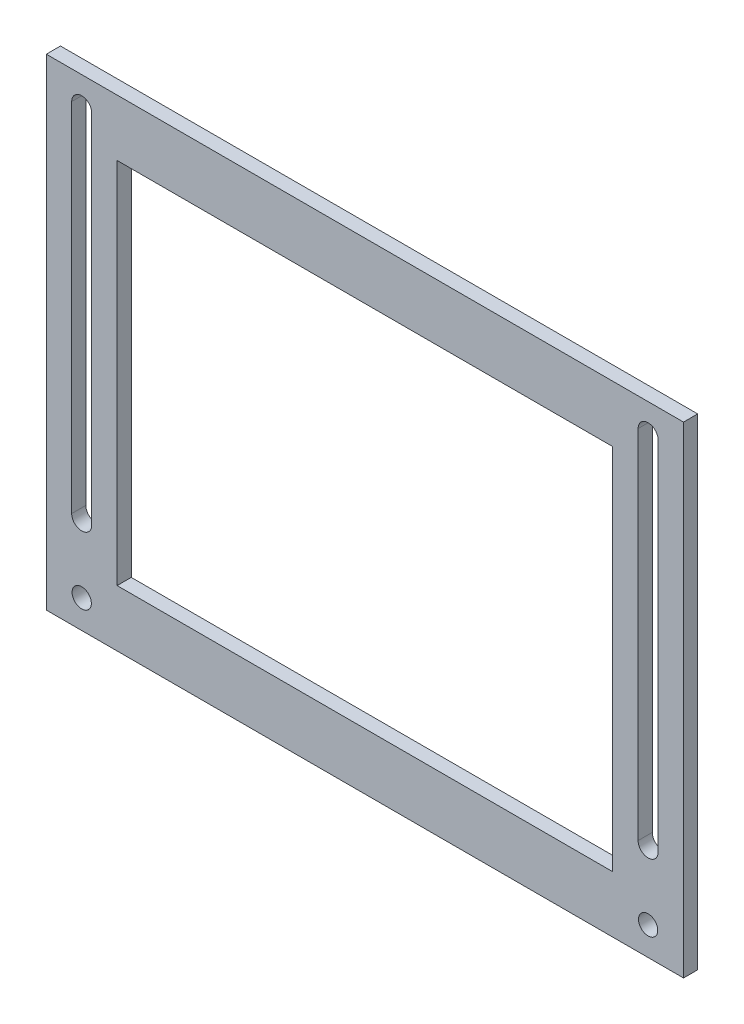
ISO-10303-21;
HEADER;
FILE_DESCRIPTION(('STEP AP214'),'2;1');
FILE_NAME('part.step','',(''),(''),'','','');
FILE_SCHEMA(('AUTOMOTIVE_DESIGN { 1 0 10303 214 1 1 1 1 }'));
ENDSEC;
DATA;
#1=APPLICATION_CONTEXT('core data for automotive mechanical design processes');
#2=APPLICATION_PROTOCOL_DEFINITION('international standard','automotive_design',2000,#1);
#3=PRODUCT_CONTEXT('',#1,'mechanical');
#4=PRODUCT('Part','Part','',(#3));
#5=PRODUCT_RELATED_PRODUCT_CATEGORY('part','',(#4));
#6=PRODUCT_DEFINITION_FORMATION('','',#4);
#7=PRODUCT_DEFINITION_CONTEXT('part definition',#1,'design');
#8=PRODUCT_DEFINITION('design','',#6,#7);
#9=PRODUCT_DEFINITION_SHAPE('','',#8);
#10=(LENGTH_UNIT() NAMED_UNIT(*) SI_UNIT(.MILLI.,.METRE.));
#11=(NAMED_UNIT(*) PLANE_ANGLE_UNIT() SI_UNIT($,.RADIAN.));
#12=(NAMED_UNIT(*) SI_UNIT($,.STERADIAN.) SOLID_ANGLE_UNIT());
#13=UNCERTAINTY_MEASURE_WITH_UNIT(LENGTH_MEASURE(1.E-05),#10,'distance_accuracy_value','');
#14=(GEOMETRIC_REPRESENTATION_CONTEXT(3) GLOBAL_UNCERTAINTY_ASSIGNED_CONTEXT((#13)) GLOBAL_UNIT_ASSIGNED_CONTEXT((#10,
#11,#12)) REPRESENTATION_CONTEXT('',''));
#15=CARTESIAN_POINT('',(0.,0.,0.));
#16=DIRECTION('',(0.,0.,1.));
#17=DIRECTION('',(1.,0.,0.));
#18=AXIS2_PLACEMENT_3D('',#15,#16,#17);
#19=CARTESIAN_POINT('',(0.,0.,3.175));
#20=DIRECTION('',(0.,0.,-1.));
#21=DIRECTION('',(-1.,0.,0.));
#22=AXIS2_PLACEMENT_3D('',#19,#20,#21);
#23=PLANE('',#22);
#24=CARTESIAN_POINT('',(134.9375,6.35,3.175));
#25=DIRECTION('',(0.,0.,1.));
#26=DIRECTION('',(-1.,0.,0.));
#27=AXIS2_PLACEMENT_3D('',#24,#25,#26);
#28=CIRCLE('',#27,2.15899999999999);
#29=CARTESIAN_POINT('',(132.7785,6.35,3.175));
#30=VERTEX_POINT('',#29);
#31=EDGE_CURVE('E182',#30,#30,#28,.T.);
#32=ORIENTED_EDGE('',*,*,#31,.F.);
#33=EDGE_LOOP('',(#32));
#34=FACE_BOUND('',#33,.T.);
#35=DIRECTION('',(-1.,0.,0.));
#36=VECTOR('',#35,1.);
#37=CARTESIAN_POINT('',(15.875,95.25,3.175));
#38=LINE('',#37,#36);
#39=CARTESIAN_POINT('',(127.,95.25,3.175));
#40=VERTEX_POINT('',#39);
#41=CARTESIAN_POINT('',(15.875,95.25,3.175));
#42=VERTEX_POINT('',#41);
#43=EDGE_CURVE('E188',#40,#42,#38,.T.);
#44=ORIENTED_EDGE('',*,*,#43,.F.);
#45=DIRECTION('',(0.,1.,0.));
#46=VECTOR('',#45,1.);
#47=CARTESIAN_POINT('',(127.,12.7,3.175));
#48=LINE('',#47,#46);
#49=CARTESIAN_POINT('',(127.,12.7,3.175));
#50=VERTEX_POINT('',#49);
#51=EDGE_CURVE('E196',#50,#40,#48,.T.);
#52=ORIENTED_EDGE('',*,*,#51,.F.);
#53=DIRECTION('',(1.,0.,0.));
#54=VECTOR('',#53,1.);
#55=CARTESIAN_POINT('',(15.875,12.7,3.175));
#56=LINE('',#55,#54);
#57=CARTESIAN_POINT('',(15.875,12.7,3.175));
#58=VERTEX_POINT('',#57);
#59=EDGE_CURVE('E193',#58,#50,#56,.T.);
#60=ORIENTED_EDGE('',*,*,#59,.F.);
#61=DIRECTION('',(0.,-1.,0.));
#62=VECTOR('',#61,1.);
#63=CARTESIAN_POINT('',(15.875,12.7,3.175));
#64=LINE('',#63,#62);
#65=EDGE_CURVE('E190',#42,#58,#64,.T.);
#66=ORIENTED_EDGE('',*,*,#65,.F.);
#67=EDGE_LOOP('',(#44,#52,#60,#66));
#68=FACE_BOUND('',#67,.T.);
#69=DIRECTION('',(0.,-1.,0.));
#70=VECTOR('',#69,1.);
#71=CARTESIAN_POINT('',(0.,0.,3.175));
#72=LINE('',#71,#70);
#73=CARTESIAN_POINT('',(0.,107.95,3.175));
#74=VERTEX_POINT('',#73);
#75=CARTESIAN_POINT('',(0.,0.,3.175));
#76=VERTEX_POINT('',#75);
#77=EDGE_CURVE('E256',#74,#76,#72,.T.);
#78=ORIENTED_EDGE('',*,*,#77,.T.);
#79=DIRECTION('',(1.,0.,0.));
#80=VECTOR('',#79,1.);
#81=CARTESIAN_POINT('',(0.,0.,3.175));
#82=LINE('',#81,#80);
#83=CARTESIAN_POINT('',(142.875,0.,3.175));
#84=VERTEX_POINT('',#83);
#85=EDGE_CURVE('E259',#76,#84,#82,.T.);
#86=ORIENTED_EDGE('',*,*,#85,.T.);
#87=DIRECTION('',(0.,1.,0.));
#88=VECTOR('',#87,1.);
#89=CARTESIAN_POINT('',(142.875,0.,3.175));
#90=LINE('',#89,#88);
#91=CARTESIAN_POINT('',(142.875,107.95,3.175));
#92=VERTEX_POINT('',#91);
#93=EDGE_CURVE('E262',#84,#92,#90,.T.);
#94=ORIENTED_EDGE('',*,*,#93,.T.);
#95=DIRECTION('',(-1.,0.,0.));
#96=VECTOR('',#95,1.);
#97=CARTESIAN_POINT('',(142.875,107.95,3.175));
#98=LINE('',#97,#96);
#99=EDGE_CURVE('E264',#92,#74,#98,.T.);
#100=ORIENTED_EDGE('',*,*,#99,.T.);
#101=EDGE_LOOP('',(#78,#86,#94,#100));
#102=FACE_BOUND('',#101,.T.);
#103=CARTESIAN_POINT('',(7.9375,101.6,3.175));
#104=DIRECTION('',(0.,0.,1.));
#105=DIRECTION('',(1.,0.,0.));
#106=AXIS2_PLACEMENT_3D('',#103,#104,#105);
#107=CIRCLE('',#106,2.2479);
#108=CARTESIAN_POINT('',(10.1854,101.6,3.175));
#109=VERTEX_POINT('',#108);
#110=CARTESIAN_POINT('',(5.6896,101.6,3.175));
#111=VERTEX_POINT('',#110);
#112=EDGE_CURVE('E225',#109,#111,#107,.T.);
#113=ORIENTED_EDGE('',*,*,#112,.F.);
#114=DIRECTION('',(0.,1.,0.));
#115=VECTOR('',#114,1.);
#116=CARTESIAN_POINT('',(10.1854,101.6,3.175));
#117=LINE('',#116,#115);
#118=CARTESIAN_POINT('',(10.1854,21.59,3.175));
#119=VERTEX_POINT('',#118);
#120=EDGE_CURVE('E233',#119,#109,#117,.T.);
#121=ORIENTED_EDGE('',*,*,#120,.F.);
#122=CARTESIAN_POINT('',(7.93750000000001,21.59,3.175));
#123=DIRECTION('',(0.,0.,1.));
#124=DIRECTION('',(1.,0.,0.));
#125=AXIS2_PLACEMENT_3D('',#122,#123,#124);
#126=CIRCLE('',#125,2.2479);
#127=CARTESIAN_POINT('',(5.68960000000001,21.59,3.175));
#128=VERTEX_POINT('',#127);
#129=EDGE_CURVE('E230',#128,#119,#126,.T.);
#130=ORIENTED_EDGE('',*,*,#129,.F.);
#131=DIRECTION('',(0.,-1.,0.));
#132=VECTOR('',#131,1.);
#133=CARTESIAN_POINT('',(5.6896,101.6,3.175));
#134=LINE('',#133,#132);
#135=EDGE_CURVE('E227',#111,#128,#134,.T.);
#136=ORIENTED_EDGE('',*,*,#135,.F.);
#137=EDGE_LOOP('',(#113,#121,#130,#136));
#138=FACE_BOUND('',#137,.T.);
#139=CARTESIAN_POINT('',(7.9375,6.35,3.175));
#140=DIRECTION('',(0.,0.,1.));
#141=DIRECTION('',(1.,0.,0.));
#142=AXIS2_PLACEMENT_3D('',#139,#140,#141);
#143=CIRCLE('',#142,2.159);
#144=CARTESIAN_POINT('',(10.0965,6.35,3.175));
#145=VERTEX_POINT('',#144);
#146=EDGE_CURVE('E219',#145,#145,#143,.T.);
#147=ORIENTED_EDGE('',*,*,#146,.F.);
#148=EDGE_LOOP('',(#147));
#149=FACE_BOUND('',#148,.T.);
#150=CARTESIAN_POINT('',(134.9375,101.6,3.175));
#151=DIRECTION('',(0.,0.,1.));
#152=DIRECTION('',(-1.,0.,0.));
#153=AXIS2_PLACEMENT_3D('',#150,#151,#152);
#154=CIRCLE('',#153,2.24789999999998);
#155=CARTESIAN_POINT('',(137.1854,101.6,3.175));
#156=VERTEX_POINT('',#155);
#157=CARTESIAN_POINT('',(132.6896,101.6,3.175));
#158=VERTEX_POINT('',#157);
#159=EDGE_CURVE('E146',#156,#158,#154,.T.);
#160=ORIENTED_EDGE('',*,*,#159,.F.);
#161=DIRECTION('',(0.,1.,0.));
#162=VECTOR('',#161,1.);
#163=CARTESIAN_POINT('',(137.1854,101.6,3.175));
#164=LINE('',#163,#162);
#165=CARTESIAN_POINT('',(137.1854,21.59,3.175));
#166=VERTEX_POINT('',#165);
#167=EDGE_CURVE('E168',#166,#156,#164,.T.);
#168=ORIENTED_EDGE('',*,*,#167,.F.);
#169=CARTESIAN_POINT('',(134.9375,21.59,3.175));
#170=DIRECTION('',(0.,0.,1.));
#171=DIRECTION('',(-1.,0.,0.));
#172=AXIS2_PLACEMENT_3D('',#169,#170,#171);
#173=CIRCLE('',#172,2.24790000000001);
#174=CARTESIAN_POINT('',(132.6896,21.59,3.175));
#175=VERTEX_POINT('',#174);
#176=EDGE_CURVE('E166',#175,#166,#173,.T.);
#177=ORIENTED_EDGE('',*,*,#176,.F.);
#178=DIRECTION('',(0.,-1.,0.));
#179=VECTOR('',#178,1.);
#180=CARTESIAN_POINT('',(132.6896,101.6,3.175));
#181=LINE('',#180,#179);
#182=EDGE_CURVE('E154',#158,#175,#181,.T.);
#183=ORIENTED_EDGE('',*,*,#182,.F.);
#184=EDGE_LOOP('',(#160,#168,#177,#183));
#185=FACE_BOUND('',#184,.T.);
#186=ADVANCED_FACE('F33',(#34,#68,#102,#138,#149,#185),#23,.F.);
#187=CARTESIAN_POINT('',(0.,0.,0.));
#188=DIRECTION('',(0.,0.,-1.));
#189=DIRECTION('',(-1.,0.,0.));
#190=AXIS2_PLACEMENT_3D('',#187,#188,#189);
#191=PLANE('',#190);
#192=DIRECTION('',(0.,1.,0.));
#193=VECTOR('',#192,1.);
#194=CARTESIAN_POINT('',(127.,12.7,0.));
#195=LINE('',#194,#193);
#196=CARTESIAN_POINT('',(127.,12.7,0.));
#197=VERTEX_POINT('',#196);
#198=CARTESIAN_POINT('',(127.,95.25,0.));
#199=VERTEX_POINT('',#198);
#200=EDGE_CURVE('E191',#197,#199,#195,.T.);
#201=ORIENTED_EDGE('',*,*,#200,.T.);
#202=DIRECTION('',(-1.,0.,0.));
#203=VECTOR('',#202,1.);
#204=CARTESIAN_POINT('',(15.875,95.25,0.));
#205=LINE('',#204,#203);
#206=CARTESIAN_POINT('',(15.875,95.25,0.));
#207=VERTEX_POINT('',#206);
#208=EDGE_CURVE('E185',#199,#207,#205,.T.);
#209=ORIENTED_EDGE('',*,*,#208,.T.);
#210=DIRECTION('',(0.,-1.,0.));
#211=VECTOR('',#210,1.);
#212=CARTESIAN_POINT('',(15.875,12.7,0.));
#213=LINE('',#212,#211);
#214=CARTESIAN_POINT('',(15.875,12.7,0.));
#215=VERTEX_POINT('',#214);
#216=EDGE_CURVE('E201',#207,#215,#213,.T.);
#217=ORIENTED_EDGE('',*,*,#216,.T.);
#218=DIRECTION('',(1.,0.,0.));
#219=VECTOR('',#218,1.);
#220=CARTESIAN_POINT('',(15.875,12.7,0.));
#221=LINE('',#220,#219);
#222=EDGE_CURVE('E204',#215,#197,#221,.T.);
#223=ORIENTED_EDGE('',*,*,#222,.T.);
#224=EDGE_LOOP('',(#201,#209,#217,#223));
#225=FACE_BOUND('',#224,.T.);
#226=CARTESIAN_POINT('',(7.9375,6.35,0.));
#227=DIRECTION('',(0.,0.,1.));
#228=DIRECTION('',(1.,0.,0.));
#229=AXIS2_PLACEMENT_3D('',#226,#227,#228);
#230=CIRCLE('',#229,2.159);
#231=CARTESIAN_POINT('',(10.0965,6.35,0.));
#232=VERTEX_POINT('',#231);
#233=EDGE_CURVE('E218',#232,#232,#230,.T.);
#234=ORIENTED_EDGE('',*,*,#233,.T.);
#235=EDGE_LOOP('',(#234));
#236=FACE_BOUND('',#235,.T.);
#237=DIRECTION('',(0.,-1.,0.));
#238=VECTOR('',#237,1.);
#239=CARTESIAN_POINT('',(0.,0.,0.));
#240=LINE('',#239,#238);
#241=CARTESIAN_POINT('',(0.,107.95,0.));
#242=VERTEX_POINT('',#241);
#243=CARTESIAN_POINT('',(0.,0.,0.));
#244=VERTEX_POINT('',#243);
#245=EDGE_CURVE('E255',#242,#244,#240,.T.);
#246=ORIENTED_EDGE('',*,*,#245,.F.);
#247=DIRECTION('',(-1.,0.,0.));
#248=VECTOR('',#247,1.);
#249=CARTESIAN_POINT('',(0.,107.95,0.));
#250=LINE('',#249,#248);
#251=CARTESIAN_POINT('',(142.875,107.95,0.));
#252=VERTEX_POINT('',#251);
#253=EDGE_CURVE('E260',#252,#242,#250,.T.);
#254=ORIENTED_EDGE('',*,*,#253,.F.);
#255=DIRECTION('',(0.,1.,0.));
#256=VECTOR('',#255,1.);
#257=CARTESIAN_POINT('',(142.875,0.,0.));
#258=LINE('',#257,#256);
#259=CARTESIAN_POINT('',(142.875,0.,0.));
#260=VERTEX_POINT('',#259);
#261=EDGE_CURVE('E271',#260,#252,#258,.T.);
#262=ORIENTED_EDGE('',*,*,#261,.F.);
#263=DIRECTION('',(1.,0.,0.));
#264=VECTOR('',#263,1.);
#265=CARTESIAN_POINT('',(142.875,0.,0.));
#266=LINE('',#265,#264);
#267=EDGE_CURVE('E269',#244,#260,#266,.T.);
#268=ORIENTED_EDGE('',*,*,#267,.F.);
#269=EDGE_LOOP('',(#246,#254,#262,#268));
#270=FACE_BOUND('',#269,.T.);
#271=DIRECTION('',(0.,1.,0.));
#272=VECTOR('',#271,1.);
#273=CARTESIAN_POINT('',(10.1854,101.6,0.));
#274=LINE('',#273,#272);
#275=CARTESIAN_POINT('',(10.1854,21.59,0.));
#276=VERTEX_POINT('',#275);
#277=CARTESIAN_POINT('',(10.1854,101.6,0.));
#278=VERTEX_POINT('',#277);
#279=EDGE_CURVE('E228',#276,#278,#274,.T.);
#280=ORIENTED_EDGE('',*,*,#279,.T.);
#281=CARTESIAN_POINT('',(7.9375,101.6,0.));
#282=DIRECTION('',(0.,0.,1.));
#283=DIRECTION('',(1.,0.,0.));
#284=AXIS2_PLACEMENT_3D('',#281,#282,#283);
#285=CIRCLE('',#284,2.2479);
#286=CARTESIAN_POINT('',(5.6896,101.6,0.));
#287=VERTEX_POINT('',#286);
#288=EDGE_CURVE('E222',#278,#287,#285,.T.);
#289=ORIENTED_EDGE('',*,*,#288,.T.);
#290=DIRECTION('',(0.,-1.,0.));
#291=VECTOR('',#290,1.);
#292=CARTESIAN_POINT('',(5.6896,101.6,0.));
#293=LINE('',#292,#291);
#294=CARTESIAN_POINT('',(5.68960000000001,21.59,0.));
#295=VERTEX_POINT('',#294);
#296=EDGE_CURVE('E238',#287,#295,#293,.T.);
#297=ORIENTED_EDGE('',*,*,#296,.T.);
#298=CARTESIAN_POINT('',(7.93750000000001,21.59,0.));
#299=DIRECTION('',(0.,0.,1.));
#300=DIRECTION('',(1.,0.,0.));
#301=AXIS2_PLACEMENT_3D('',#298,#299,#300);
#302=CIRCLE('',#301,2.2479);
#303=EDGE_CURVE('E241',#295,#276,#302,.T.);
#304=ORIENTED_EDGE('',*,*,#303,.T.);
#305=EDGE_LOOP('',(#280,#289,#297,#304));
#306=FACE_BOUND('',#305,.T.);
#307=CARTESIAN_POINT('',(134.9375,6.35,0.));
#308=DIRECTION('',(0.,0.,1.));
#309=DIRECTION('',(-1.,0.,0.));
#310=AXIS2_PLACEMENT_3D('',#307,#308,#309);
#311=CIRCLE('',#310,2.15899999999999);
#312=CARTESIAN_POINT('',(132.7785,6.35,0.));
#313=VERTEX_POINT('',#312);
#314=EDGE_CURVE('E162',#313,#313,#311,.T.);
#315=ORIENTED_EDGE('',*,*,#314,.T.);
#316=EDGE_LOOP('',(#315));
#317=FACE_BOUND('',#316,.T.);
#318=DIRECTION('',(0.,1.,0.));
#319=VECTOR('',#318,1.);
#320=CARTESIAN_POINT('',(137.1854,101.6,0.));
#321=LINE('',#320,#319);
#322=CARTESIAN_POINT('',(137.1854,21.59,0.));
#323=VERTEX_POINT('',#322);
#324=CARTESIAN_POINT('',(137.1854,101.6,0.));
#325=VERTEX_POINT('',#324);
#326=EDGE_CURVE('E155',#323,#325,#321,.T.);
#327=ORIENTED_EDGE('',*,*,#326,.T.);
#328=CARTESIAN_POINT('',(134.9375,101.6,0.));
#329=DIRECTION('',(0.,0.,1.));
#330=DIRECTION('',(-1.,0.,0.));
#331=AXIS2_PLACEMENT_3D('',#328,#329,#330);
#332=CIRCLE('',#331,2.24789999999998);
#333=CARTESIAN_POINT('',(132.6896,101.6,0.));
#334=VERTEX_POINT('',#333);
#335=EDGE_CURVE('E56',#325,#334,#332,.T.);
#336=ORIENTED_EDGE('',*,*,#335,.T.);
#337=DIRECTION('',(0.,-1.,0.));
#338=VECTOR('',#337,1.);
#339=CARTESIAN_POINT('',(132.6896,101.6,0.));
#340=LINE('',#339,#338);
#341=CARTESIAN_POINT('',(132.6896,21.59,0.));
#342=VERTEX_POINT('',#341);
#343=EDGE_CURVE('E161',#334,#342,#340,.T.);
#344=ORIENTED_EDGE('',*,*,#343,.T.);
#345=CARTESIAN_POINT('',(134.9375,21.59,0.));
#346=DIRECTION('',(0.,0.,1.));
#347=DIRECTION('',(-1.,0.,0.));
#348=AXIS2_PLACEMENT_3D('',#345,#346,#347);
#349=CIRCLE('',#348,2.24790000000001);
#350=EDGE_CURVE('E174',#342,#323,#349,.T.);
#351=ORIENTED_EDGE('',*,*,#350,.T.);
#352=EDGE_LOOP('',(#327,#336,#344,#351));
#353=FACE_BOUND('',#352,.T.);
#354=ADVANCED_FACE('F289',(#225,#236,#270,#306,#317,#353),#191,.T.);
#355=CARTESIAN_POINT('',(0.,0.,3.175));
#356=DIRECTION('',(1.,0.,0.));
#357=DIRECTION('',(0.,0.,-1.));
#358=AXIS2_PLACEMENT_3D('',#355,#356,#357);
#359=PLANE('',#358);
#360=ORIENTED_EDGE('',*,*,#245,.T.);
#361=DIRECTION('',(0.,0.,-1.));
#362=VECTOR('',#361,1.);
#363=CARTESIAN_POINT('',(0.,0.,3.175));
#364=LINE('',#363,#362);
#365=EDGE_CURVE('E11',#76,#244,#364,.T.);
#366=ORIENTED_EDGE('',*,*,#365,.F.);
#367=ORIENTED_EDGE('',*,*,#77,.F.);
#368=DIRECTION('',(0.,0.,-1.));
#369=VECTOR('',#368,1.);
#370=CARTESIAN_POINT('',(0.,107.95,3.175));
#371=LINE('',#370,#369);
#372=EDGE_CURVE('E266',#74,#242,#371,.T.);
#373=ORIENTED_EDGE('',*,*,#372,.T.);
#374=EDGE_LOOP('',(#360,#366,#367,#373));
#375=FACE_BOUND('',#374,.T.);
#376=ADVANCED_FACE('F35',(#375),#359,.F.);
#377=CARTESIAN_POINT('',(142.875,0.,3.175));
#378=DIRECTION('',(0.,1.,0.));
#379=DIRECTION('',(0.,0.,1.));
#380=AXIS2_PLACEMENT_3D('',#377,#378,#379);
#381=PLANE('',#380);
#382=ORIENTED_EDGE('',*,*,#267,.T.);
#383=DIRECTION('',(0.,0.,-1.));
#384=VECTOR('',#383,1.);
#385=CARTESIAN_POINT('',(142.875,0.,3.175));
#386=LINE('',#385,#384);
#387=EDGE_CURVE('E41',#84,#260,#386,.T.);
#388=ORIENTED_EDGE('',*,*,#387,.F.);
#389=ORIENTED_EDGE('',*,*,#85,.F.);
#390=ORIENTED_EDGE('',*,*,#365,.T.);
#391=EDGE_LOOP('',(#382,#388,#389,#390));
#392=FACE_BOUND('',#391,.T.);
#393=ADVANCED_FACE('F300',(#392),#381,.F.);
#394=CARTESIAN_POINT('',(142.875,0.,3.175));
#395=DIRECTION('',(-1.,0.,0.));
#396=DIRECTION('',(0.,0.,1.));
#397=AXIS2_PLACEMENT_3D('',#394,#395,#396);
#398=PLANE('',#397);
#399=ORIENTED_EDGE('',*,*,#261,.T.);
#400=DIRECTION('',(0.,0.,-1.));
#401=VECTOR('',#400,1.);
#402=CARTESIAN_POINT('',(142.875,107.95,3.175));
#403=LINE('',#402,#401);
#404=EDGE_CURVE('E277',#92,#252,#403,.T.);
#405=ORIENTED_EDGE('',*,*,#404,.F.);
#406=ORIENTED_EDGE('',*,*,#93,.F.);
#407=ORIENTED_EDGE('',*,*,#387,.T.);
#408=EDGE_LOOP('',(#399,#405,#406,#407));
#409=FACE_BOUND('',#408,.T.);
#410=ADVANCED_FACE('F284',(#409),#398,.F.);
#411=CARTESIAN_POINT('',(0.,107.95,3.175));
#412=DIRECTION('',(0.,-1.,0.));
#413=DIRECTION('',(0.,0.,-1.));
#414=AXIS2_PLACEMENT_3D('',#411,#412,#413);
#415=PLANE('',#414);
#416=ORIENTED_EDGE('',*,*,#253,.T.);
#417=ORIENTED_EDGE('',*,*,#372,.F.);
#418=ORIENTED_EDGE('',*,*,#99,.F.);
#419=ORIENTED_EDGE('',*,*,#404,.T.);
#420=EDGE_LOOP('',(#416,#417,#418,#419));
#421=FACE_BOUND('',#420,.T.);
#422=ADVANCED_FACE('F293',(#421),#415,.F.);
#423=CARTESIAN_POINT('',(7.9375,101.6,3.175));
#424=DIRECTION('',(0.,0.,-1.));
#425=DIRECTION('',(-1.,0.,0.));
#426=AXIS2_PLACEMENT_3D('',#423,#424,#425);
#427=CYLINDRICAL_SURFACE('',#426,2.2479);
#428=ORIENTED_EDGE('',*,*,#288,.F.);
#429=DIRECTION('',(0.,0.,-1.));
#430=VECTOR('',#429,1.);
#431=CARTESIAN_POINT('',(10.1854,101.6,3.175));
#432=LINE('',#431,#430);
#433=EDGE_CURVE('E235',#109,#278,#432,.T.);
#434=ORIENTED_EDGE('',*,*,#433,.F.);
#435=ORIENTED_EDGE('',*,*,#112,.T.);
#436=DIRECTION('',(0.,0.,-1.));
#437=VECTOR('',#436,1.);
#438=CARTESIAN_POINT('',(5.6896,101.6,3.175));
#439=LINE('',#438,#437);
#440=EDGE_CURVE('E252',#111,#287,#439,.T.);
#441=ORIENTED_EDGE('',*,*,#440,.T.);
#442=EDGE_LOOP('',(#428,#434,#435,#441));
#443=FACE_BOUND('',#442,.T.);
#444=ADVANCED_FACE('F318',(#443),#427,.F.);
#445=CARTESIAN_POINT('',(5.6896,101.6,3.175));
#446=DIRECTION('',(1.,0.,0.));
#447=DIRECTION('',(0.,1.,0.));
#448=AXIS2_PLACEMENT_3D('',#445,#446,#447);
#449=PLANE('',#448);
#450=ORIENTED_EDGE('',*,*,#296,.F.);
#451=ORIENTED_EDGE('',*,*,#440,.F.);
#452=ORIENTED_EDGE('',*,*,#135,.T.);
#453=DIRECTION('',(0.,0.,-1.));
#454=VECTOR('',#453,1.);
#455=CARTESIAN_POINT('',(5.68960000000001,21.59,3.175));
#456=LINE('',#455,#454);
#457=EDGE_CURVE('E250',#128,#295,#456,.T.);
#458=ORIENTED_EDGE('',*,*,#457,.T.);
#459=EDGE_LOOP('',(#450,#451,#452,#458));
#460=FACE_BOUND('',#459,.T.);
#461=ADVANCED_FACE('F325',(#460),#449,.T.);
#462=CARTESIAN_POINT('',(7.93750000000001,21.59,3.175));
#463=DIRECTION('',(0.,0.,-1.));
#464=DIRECTION('',(-1.,0.,0.));
#465=AXIS2_PLACEMENT_3D('',#462,#463,#464);
#466=CYLINDRICAL_SURFACE('',#465,2.2479);
#467=ORIENTED_EDGE('',*,*,#303,.F.);
#468=ORIENTED_EDGE('',*,*,#457,.F.);
#469=ORIENTED_EDGE('',*,*,#129,.T.);
#470=DIRECTION('',(0.,0.,-1.));
#471=VECTOR('',#470,1.);
#472=CARTESIAN_POINT('',(10.1854,21.59,3.175));
#473=LINE('',#472,#471);
#474=EDGE_CURVE('E248',#119,#276,#473,.T.);
#475=ORIENTED_EDGE('',*,*,#474,.T.);
#476=EDGE_LOOP('',(#467,#468,#469,#475));
#477=FACE_BOUND('',#476,.T.);
#478=ADVANCED_FACE('F330',(#477),#466,.F.);
#479=CARTESIAN_POINT('',(10.1854,101.6,3.175));
#480=DIRECTION('',(-1.,0.,0.));
#481=DIRECTION('',(0.,-1.,0.));
#482=AXIS2_PLACEMENT_3D('',#479,#480,#481);
#483=PLANE('',#482);
#484=ORIENTED_EDGE('',*,*,#279,.F.);
#485=ORIENTED_EDGE('',*,*,#474,.F.);
#486=ORIENTED_EDGE('',*,*,#120,.T.);
#487=ORIENTED_EDGE('',*,*,#433,.T.);
#488=EDGE_LOOP('',(#484,#485,#486,#487));
#489=FACE_BOUND('',#488,.T.);
#490=ADVANCED_FACE('F337',(#489),#483,.T.);
#491=CARTESIAN_POINT('',(7.9375,6.35,3.175));
#492=DIRECTION('',(0.,0.,-1.));
#493=DIRECTION('',(-1.,0.,0.));
#494=AXIS2_PLACEMENT_3D('',#491,#492,#493);
#495=CYLINDRICAL_SURFACE('',#494,2.159);
#496=ORIENTED_EDGE('',*,*,#146,.T.);
#497=EDGE_LOOP('',(#496));
#498=FACE_BOUND('',#497,.T.);
#499=ORIENTED_EDGE('',*,*,#233,.F.);
#500=EDGE_LOOP('',(#499));
#501=FACE_BOUND('',#500,.T.);
#502=ADVANCED_FACE('F348',(#498,#501),#495,.F.);
#503=CARTESIAN_POINT('',(15.875,95.25,3.175));
#504=DIRECTION('',(0.,-1.,0.));
#505=DIRECTION('',(0.,0.,-1.));
#506=AXIS2_PLACEMENT_3D('',#503,#504,#505);
#507=PLANE('',#506);
#508=ORIENTED_EDGE('',*,*,#208,.F.);
#509=DIRECTION('',(0.,0.,-1.));
#510=VECTOR('',#509,1.);
#511=CARTESIAN_POINT('',(127.,95.25,3.175));
#512=LINE('',#511,#510);
#513=EDGE_CURVE('E198',#40,#199,#512,.T.);
#514=ORIENTED_EDGE('',*,*,#513,.F.);
#515=ORIENTED_EDGE('',*,*,#43,.T.);
#516=DIRECTION('',(0.,0.,-1.));
#517=VECTOR('',#516,1.);
#518=CARTESIAN_POINT('',(15.875,95.25,3.175));
#519=LINE('',#518,#517);
#520=EDGE_CURVE('E215',#42,#207,#519,.T.);
#521=ORIENTED_EDGE('',*,*,#520,.T.);
#522=EDGE_LOOP('',(#508,#514,#515,#521));
#523=FACE_BOUND('',#522,.T.);
#524=ADVANCED_FACE('F351',(#523),#507,.T.);
#525=CARTESIAN_POINT('',(15.875,12.7,3.175));
#526=DIRECTION('',(1.,0.,0.));
#527=DIRECTION('',(0.,1.,0.));
#528=AXIS2_PLACEMENT_3D('',#525,#526,#527);
#529=PLANE('',#528);
#530=ORIENTED_EDGE('',*,*,#216,.F.);
#531=ORIENTED_EDGE('',*,*,#520,.F.);
#532=ORIENTED_EDGE('',*,*,#65,.T.);
#533=DIRECTION('',(0.,0.,-1.));
#534=VECTOR('',#533,1.);
#535=CARTESIAN_POINT('',(15.875,12.7,3.175));
#536=LINE('',#535,#534);
#537=EDGE_CURVE('E213',#58,#215,#536,.T.);
#538=ORIENTED_EDGE('',*,*,#537,.T.);
#539=EDGE_LOOP('',(#530,#531,#532,#538));
#540=FACE_BOUND('',#539,.T.);
#541=ADVANCED_FACE('F359',(#540),#529,.T.);
#542=CARTESIAN_POINT('',(15.875,12.7,3.175));
#543=DIRECTION('',(0.,1.,0.));
#544=DIRECTION('',(0.,0.,1.));
#545=AXIS2_PLACEMENT_3D('',#542,#543,#544);
#546=PLANE('',#545);
#547=ORIENTED_EDGE('',*,*,#222,.F.);
#548=ORIENTED_EDGE('',*,*,#537,.F.);
#549=ORIENTED_EDGE('',*,*,#59,.T.);
#550=DIRECTION('',(0.,0.,-1.));
#551=VECTOR('',#550,1.);
#552=CARTESIAN_POINT('',(127.,12.7,3.175));
#553=LINE('',#552,#551);
#554=EDGE_CURVE('E211',#50,#197,#553,.T.);
#555=ORIENTED_EDGE('',*,*,#554,.T.);
#556=EDGE_LOOP('',(#547,#548,#549,#555));
#557=FACE_BOUND('',#556,.T.);
#558=ADVANCED_FACE('F393',(#557),#546,.T.);
#559=CARTESIAN_POINT('',(127.,12.7,3.175));
#560=DIRECTION('',(-1.,0.,0.));
#561=DIRECTION('',(0.,0.,1.));
#562=AXIS2_PLACEMENT_3D('',#559,#560,#561);
#563=PLANE('',#562);
#564=ORIENTED_EDGE('',*,*,#200,.F.);
#565=ORIENTED_EDGE('',*,*,#554,.F.);
#566=ORIENTED_EDGE('',*,*,#51,.T.);
#567=ORIENTED_EDGE('',*,*,#513,.T.);
#568=EDGE_LOOP('',(#564,#565,#566,#567));
#569=FACE_BOUND('',#568,.T.);
#570=ADVANCED_FACE('F402',(#569),#563,.T.);
#571=CARTESIAN_POINT('',(134.9375,6.35,3.175));
#572=DIRECTION('',(0.,0.,-1.));
#573=DIRECTION('',(-1.,0.,0.));
#574=AXIS2_PLACEMENT_3D('',#571,#572,#573);
#575=CYLINDRICAL_SURFACE('',#574,2.15899999999999);
#576=ORIENTED_EDGE('',*,*,#31,.T.);
#577=EDGE_LOOP('',(#576));
#578=FACE_BOUND('',#577,.T.);
#579=ORIENTED_EDGE('',*,*,#314,.F.);
#580=EDGE_LOOP('',(#579));
#581=FACE_BOUND('',#580,.T.);
#582=ADVANCED_FACE('F412',(#578,#581),#575,.F.);
#583=CARTESIAN_POINT('',(134.9375,101.6,3.175));
#584=DIRECTION('',(0.,0.,-1.));
#585=DIRECTION('',(-1.,0.,0.));
#586=AXIS2_PLACEMENT_3D('',#583,#584,#585);
#587=CYLINDRICAL_SURFACE('',#586,2.24789999999998);
#588=ORIENTED_EDGE('',*,*,#335,.F.);
#589=DIRECTION('',(0.,0.,-1.));
#590=VECTOR('',#589,1.);
#591=CARTESIAN_POINT('',(137.1854,101.6,3.175));
#592=LINE('',#591,#590);
#593=EDGE_CURVE('E150',#156,#325,#592,.T.);
#594=ORIENTED_EDGE('',*,*,#593,.F.);
#595=ORIENTED_EDGE('',*,*,#159,.T.);
#596=DIRECTION('',(0.,0.,-1.));
#597=VECTOR('',#596,1.);
#598=CARTESIAN_POINT('',(132.6896,101.6,3.175));
#599=LINE('',#598,#597);
#600=EDGE_CURVE('E149',#158,#334,#599,.T.);
#601=ORIENTED_EDGE('',*,*,#600,.T.);
#602=EDGE_LOOP('',(#588,#594,#595,#601));
#603=FACE_BOUND('',#602,.T.);
#604=ADVANCED_FACE('F148',(#603),#587,.F.);
#605=CARTESIAN_POINT('',(132.6896,101.6,3.175));
#606=DIRECTION('',(1.,0.,0.));
#607=DIRECTION('',(0.,1.,0.));
#608=AXIS2_PLACEMENT_3D('',#605,#606,#607);
#609=PLANE('',#608);
#610=ORIENTED_EDGE('',*,*,#343,.F.);
#611=ORIENTED_EDGE('',*,*,#600,.F.);
#612=ORIENTED_EDGE('',*,*,#182,.T.);
#613=DIRECTION('',(0.,0.,-1.));
#614=VECTOR('',#613,1.);
#615=CARTESIAN_POINT('',(132.6896,21.59,3.175));
#616=LINE('',#615,#614);
#617=EDGE_CURVE('E163',#175,#342,#616,.T.);
#618=ORIENTED_EDGE('',*,*,#617,.T.);
#619=EDGE_LOOP('',(#610,#611,#612,#618));
#620=FACE_BOUND('',#619,.T.);
#621=ADVANCED_FACE('F158',(#620),#609,.T.);
#622=CARTESIAN_POINT('',(134.9375,21.59,3.175));
#623=DIRECTION('',(0.,0.,-1.));
#624=DIRECTION('',(-1.,0.,0.));
#625=AXIS2_PLACEMENT_3D('',#622,#623,#624);
#626=CYLINDRICAL_SURFACE('',#625,2.24790000000001);
#627=ORIENTED_EDGE('',*,*,#350,.F.);
#628=ORIENTED_EDGE('',*,*,#617,.F.);
#629=ORIENTED_EDGE('',*,*,#176,.T.);
#630=DIRECTION('',(0.,0.,-1.));
#631=VECTOR('',#630,1.);
#632=CARTESIAN_POINT('',(137.1854,21.59,3.175));
#633=LINE('',#632,#631);
#634=EDGE_CURVE('E48',#166,#323,#633,.T.);
#635=ORIENTED_EDGE('',*,*,#634,.T.);
#636=EDGE_LOOP('',(#627,#628,#629,#635));
#637=FACE_BOUND('',#636,.T.);
#638=ADVANCED_FACE('F439',(#637),#626,.F.);
#639=CARTESIAN_POINT('',(137.1854,101.6,3.175));
#640=DIRECTION('',(-1.,0.,0.));
#641=DIRECTION('',(0.,-1.,0.));
#642=AXIS2_PLACEMENT_3D('',#639,#640,#641);
#643=PLANE('',#642);
#644=ORIENTED_EDGE('',*,*,#326,.F.);
#645=ORIENTED_EDGE('',*,*,#634,.F.);
#646=ORIENTED_EDGE('',*,*,#167,.T.);
#647=ORIENTED_EDGE('',*,*,#593,.T.);
#648=EDGE_LOOP('',(#644,#645,#646,#647));
#649=FACE_BOUND('',#648,.T.);
#650=ADVANCED_FACE('F448',(#649),#643,.T.);
#651=CLOSED_SHELL('',(#186,#354,#376,#393,#410,#422,#444,#461,#478,#490,#502,#524,#541,#558,
#570,#582,#604,#621,#638,#650));
#652=MANIFOLD_SOLID_BREP('B2',#651);
#653=ADVANCED_BREP_SHAPE_REPRESENTATION('',(#18,#652),#14);
#654=SHAPE_DEFINITION_REPRESENTATION(#9,#653);
ENDSEC;
END-ISO-10303-21;
